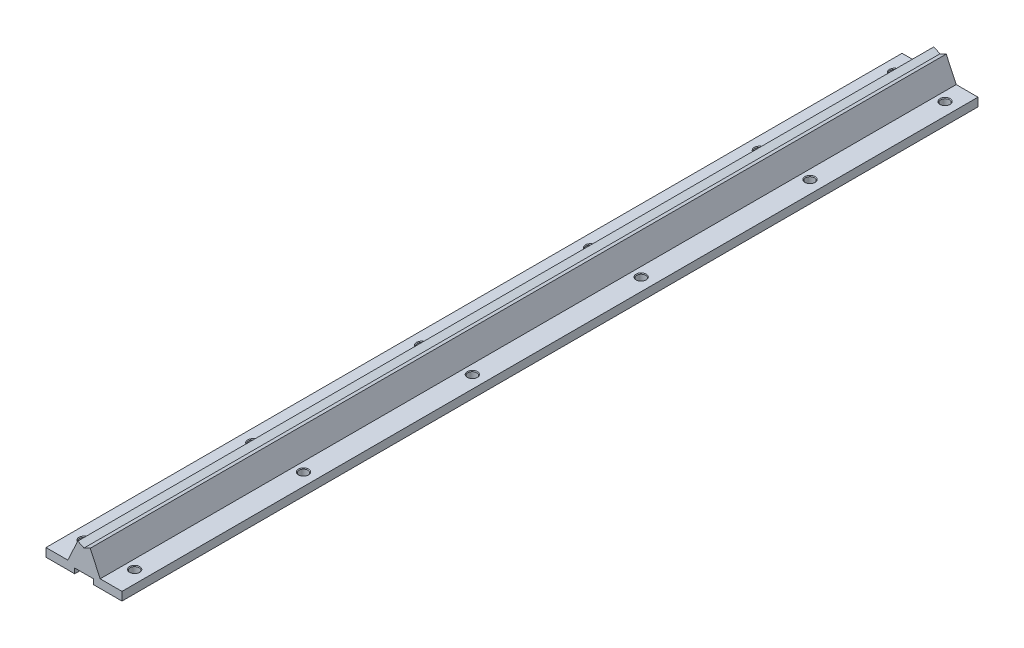
ISO-10303-21;
HEADER;
FILE_DESCRIPTION(('STEP AP214'),'2;1');
FILE_NAME('part.step','',(''),(''),'','','');
FILE_SCHEMA(('AUTOMOTIVE_DESIGN { 1 0 10303 214 1 1 1 1 }'));
ENDSEC;
DATA;
#1=APPLICATION_CONTEXT('core data for automotive mechanical design processes');
#2=APPLICATION_PROTOCOL_DEFINITION('international standard','automotive_design',2000,#1);
#3=PRODUCT_CONTEXT('',#1,'mechanical');
#4=PRODUCT('Part','Part','',(#3));
#5=PRODUCT_RELATED_PRODUCT_CATEGORY('part','',(#4));
#6=PRODUCT_DEFINITION_FORMATION('','',#4);
#7=PRODUCT_DEFINITION_CONTEXT('part definition',#1,'design');
#8=PRODUCT_DEFINITION('design','',#6,#7);
#9=PRODUCT_DEFINITION_SHAPE('','',#8);
#10=(LENGTH_UNIT() NAMED_UNIT(*) SI_UNIT(.MILLI.,.METRE.));
#11=(NAMED_UNIT(*) PLANE_ANGLE_UNIT() SI_UNIT($,.RADIAN.));
#12=(NAMED_UNIT(*) SI_UNIT($,.STERADIAN.) SOLID_ANGLE_UNIT());
#13=UNCERTAINTY_MEASURE_WITH_UNIT(LENGTH_MEASURE(1.E-05),#10,'distance_accuracy_value','');
#14=(GEOMETRIC_REPRESENTATION_CONTEXT(3) GLOBAL_UNCERTAINTY_ASSIGNED_CONTEXT((#13)) GLOBAL_UNIT_ASSIGNED_CONTEXT((#10,
#11,#12)) REPRESENTATION_CONTEXT('',''));
#15=CARTESIAN_POINT('',(0.,0.,0.));
#16=DIRECTION('',(0.,0.,1.));
#17=DIRECTION('',(1.,0.,0.));
#18=AXIS2_PLACEMENT_3D('',#15,#16,#17);
#19=CARTESIAN_POINT('',(9.5977024484662,5.,507.));
#20=DIRECTION('',(0.,-1.,0.));
#21=DIRECTION('',(0.,0.,-1.));
#22=AXIS2_PLACEMENT_3D('',#19,#20,#21);
#23=PLANE('',#22);
#24=CARTESIAN_POINT('',(15.,5.,12.));
#25=DIRECTION('',(0.,1.,0.));
#26=DIRECTION('',(0.,0.,1.));
#27=AXIS2_PLACEMENT_3D('',#24,#25,#26);
#28=CIRCLE('',#27,3.);
#29=CARTESIAN_POINT('',(15.,5.,15.));
#30=VERTEX_POINT('',#29);
#31=EDGE_CURVE('E273',#30,#30,#28,.T.);
#32=ORIENTED_EDGE('',*,*,#31,.F.);
#33=EDGE_LOOP('',(#32));
#34=FACE_BOUND('',#33,.T.);
#35=CARTESIAN_POINT('',(15.,5.,92.));
#36=DIRECTION('',(0.,1.,0.));
#37=DIRECTION('',(0.,0.,1.));
#38=AXIS2_PLACEMENT_3D('',#35,#36,#37);
#39=CIRCLE('',#38,3.);
#40=CARTESIAN_POINT('',(15.,5.,95.));
#41=VERTEX_POINT('',#40);
#42=EDGE_CURVE('E262',#41,#41,#39,.T.);
#43=ORIENTED_EDGE('',*,*,#42,.F.);
#44=EDGE_LOOP('',(#43));
#45=FACE_BOUND('',#44,.T.);
#46=CARTESIAN_POINT('',(15.,5.,192.));
#47=DIRECTION('',(0.,1.,0.));
#48=DIRECTION('',(0.,0.,1.));
#49=AXIS2_PLACEMENT_3D('',#46,#47,#48);
#50=CIRCLE('',#49,3.);
#51=CARTESIAN_POINT('',(15.,5.,195.));
#52=VERTEX_POINT('',#51);
#53=EDGE_CURVE('E253',#52,#52,#50,.T.);
#54=ORIENTED_EDGE('',*,*,#53,.F.);
#55=EDGE_LOOP('',(#54));
#56=FACE_BOUND('',#55,.T.);
#57=CARTESIAN_POINT('',(15.,5.,392.));
#58=DIRECTION('',(0.,1.,0.));
#59=DIRECTION('',(0.,0.,1.));
#60=AXIS2_PLACEMENT_3D('',#57,#58,#59);
#61=CIRCLE('',#60,3.);
#62=CARTESIAN_POINT('',(15.,5.,395.));
#63=VERTEX_POINT('',#62);
#64=EDGE_CURVE('E233',#63,#63,#61,.T.);
#65=ORIENTED_EDGE('',*,*,#64,.F.);
#66=EDGE_LOOP('',(#65));
#67=FACE_BOUND('',#66,.T.);
#68=CARTESIAN_POINT('',(14.9999999999999,5.,492.));
#69=DIRECTION('',(0.,1.,0.));
#70=DIRECTION('',(0.,0.,1.));
#71=AXIS2_PLACEMENT_3D('',#68,#69,#70);
#72=CIRCLE('',#71,3.);
#73=CARTESIAN_POINT('',(14.9999999999999,5.,495.));
#74=VERTEX_POINT('',#73);
#75=EDGE_CURVE('E223',#74,#74,#72,.T.);
#76=ORIENTED_EDGE('',*,*,#75,.F.);
#77=EDGE_LOOP('',(#76));
#78=FACE_BOUND('',#77,.T.);
#79=DIRECTION('',(-1.,0.,0.));
#80=VECTOR('',#79,1.);
#81=CARTESIAN_POINT('',(9.5977024484662,5.,0.));
#82=LINE('',#81,#80);
#83=CARTESIAN_POINT('',(22.5,5.,0.));
#84=VERTEX_POINT('',#83);
#85=CARTESIAN_POINT('',(9.5977024484662,5.,0.));
#86=VERTEX_POINT('',#85);
#87=EDGE_CURVE('E171',#84,#86,#82,.T.);
#88=ORIENTED_EDGE('',*,*,#87,.T.);
#89=DIRECTION('',(0.,0.,-1.));
#90=VECTOR('',#89,1.);
#91=CARTESIAN_POINT('',(9.5977024484662,5.,507.));
#92=LINE('',#91,#90);
#93=CARTESIAN_POINT('',(9.5977024484662,5.,507.));
#94=VERTEX_POINT('',#93);
#95=EDGE_CURVE('E212',#94,#86,#92,.T.);
#96=ORIENTED_EDGE('',*,*,#95,.F.);
#97=DIRECTION('',(-1.,0.,0.));
#98=VECTOR('',#97,1.);
#99=CARTESIAN_POINT('',(9.5977024484662,5.,507.));
#100=LINE('',#99,#98);
#101=CARTESIAN_POINT('',(22.5,5.,507.));
#102=VERTEX_POINT('',#101);
#103=EDGE_CURVE('E321',#102,#94,#100,.T.);
#104=ORIENTED_EDGE('',*,*,#103,.F.);
#105=DIRECTION('',(0.,0.,-1.));
#106=VECTOR('',#105,1.);
#107=CARTESIAN_POINT('',(22.5,5.,507.));
#108=LINE('',#107,#106);
#109=EDGE_CURVE('E46',#102,#84,#108,.T.);
#110=ORIENTED_EDGE('',*,*,#109,.T.);
#111=EDGE_LOOP('',(#88,#96,#104,#110));
#112=FACE_BOUND('',#111,.T.);
#113=CARTESIAN_POINT('',(15.,5.,292.));
#114=DIRECTION('',(0.,1.,0.));
#115=DIRECTION('',(0.,0.,1.));
#116=AXIS2_PLACEMENT_3D('',#113,#114,#115);
#117=CIRCLE('',#116,3.);
#118=CARTESIAN_POINT('',(15.,5.,295.));
#119=VERTEX_POINT('',#118);
#120=EDGE_CURVE('E243',#119,#119,#117,.T.);
#121=ORIENTED_EDGE('',*,*,#120,.F.);
#122=EDGE_LOOP('',(#121));
#123=FACE_BOUND('',#122,.T.);
#124=ADVANCED_FACE('F36',(#34,#45,#56,#67,#78,#112,#123),#23,.F.);
#125=CARTESIAN_POINT('',(5.5,0.,507.));
#126=DIRECTION('',(0.,1.,0.));
#127=DIRECTION('',(-1.,0.,0.));
#128=AXIS2_PLACEMENT_3D('',#125,#126,#127);
#129=PLANE('',#128);
#130=CARTESIAN_POINT('',(15.,0.,12.));
#131=DIRECTION('',(0.,1.,0.));
#132=DIRECTION('',(-1.,0.,0.));
#133=AXIS2_PLACEMENT_3D('',#130,#131,#132);
#134=CIRCLE('',#133,2.59999999999999);
#135=CARTESIAN_POINT('',(12.4,0.,12.));
#136=VERTEX_POINT('',#135);
#137=EDGE_CURVE('E264',#136,#136,#134,.T.);
#138=ORIENTED_EDGE('',*,*,#137,.T.);
#139=EDGE_LOOP('',(#138));
#140=FACE_BOUND('',#139,.T.);
#141=CARTESIAN_POINT('',(15.,0.,92.));
#142=DIRECTION('',(0.,1.,0.));
#143=DIRECTION('',(-1.,0.,0.));
#144=AXIS2_PLACEMENT_3D('',#141,#142,#143);
#145=CIRCLE('',#144,2.59999999999999);
#146=CARTESIAN_POINT('',(12.4,0.,92.));
#147=VERTEX_POINT('',#146);
#148=EDGE_CURVE('E255',#147,#147,#145,.T.);
#149=ORIENTED_EDGE('',*,*,#148,.T.);
#150=EDGE_LOOP('',(#149));
#151=FACE_BOUND('',#150,.T.);
#152=CARTESIAN_POINT('',(15.,0.,192.));
#153=DIRECTION('',(0.,1.,0.));
#154=DIRECTION('',(-1.,0.,0.));
#155=AXIS2_PLACEMENT_3D('',#152,#153,#154);
#156=CIRCLE('',#155,2.59999999999999);
#157=CARTESIAN_POINT('',(12.4,0.,192.));
#158=VERTEX_POINT('',#157);
#159=EDGE_CURVE('E245',#158,#158,#156,.T.);
#160=ORIENTED_EDGE('',*,*,#159,.T.);
#161=EDGE_LOOP('',(#160));
#162=FACE_BOUND('',#161,.T.);
#163=CARTESIAN_POINT('',(15.,0.,292.));
#164=DIRECTION('',(0.,1.,0.));
#165=DIRECTION('',(-1.,0.,0.));
#166=AXIS2_PLACEMENT_3D('',#163,#164,#165);
#167=CIRCLE('',#166,2.59999999999999);
#168=CARTESIAN_POINT('',(12.4,0.,292.));
#169=VERTEX_POINT('',#168);
#170=EDGE_CURVE('E235',#169,#169,#167,.T.);
#171=ORIENTED_EDGE('',*,*,#170,.T.);
#172=EDGE_LOOP('',(#171));
#173=FACE_BOUND('',#172,.T.);
#174=CARTESIAN_POINT('',(15.,0.,392.));
#175=DIRECTION('',(0.,1.,0.));
#176=DIRECTION('',(-1.,0.,0.));
#177=AXIS2_PLACEMENT_3D('',#174,#175,#176);
#178=CIRCLE('',#177,2.59999999999999);
#179=CARTESIAN_POINT('',(12.4,0.,392.));
#180=VERTEX_POINT('',#179);
#181=EDGE_CURVE('E225',#180,#180,#178,.T.);
#182=ORIENTED_EDGE('',*,*,#181,.T.);
#183=EDGE_LOOP('',(#182));
#184=FACE_BOUND('',#183,.T.);
#185=CARTESIAN_POINT('',(14.9999999999999,0.,492.));
#186=DIRECTION('',(0.,1.,0.));
#187=DIRECTION('',(-1.,0.,0.));
#188=AXIS2_PLACEMENT_3D('',#185,#186,#187);
#189=CIRCLE('',#188,2.59999999999999);
#190=CARTESIAN_POINT('',(12.3999999999999,0.,492.));
#191=VERTEX_POINT('',#190);
#192=EDGE_CURVE('E169',#191,#191,#189,.T.);
#193=ORIENTED_EDGE('',*,*,#192,.T.);
#194=EDGE_LOOP('',(#193));
#195=FACE_BOUND('',#194,.T.);
#196=DIRECTION('',(1.,0.,0.));
#197=VECTOR('',#196,1.);
#198=CARTESIAN_POINT('',(5.5,0.,0.));
#199=LINE('',#198,#197);
#200=CARTESIAN_POINT('',(5.5,0.,0.));
#201=VERTEX_POINT('',#200);
#202=CARTESIAN_POINT('',(22.5,0.,0.));
#203=VERTEX_POINT('',#202);
#204=EDGE_CURVE('E165',#201,#203,#199,.T.);
#205=ORIENTED_EDGE('',*,*,#204,.T.);
#206=DIRECTION('',(0.,0.,-1.));
#207=VECTOR('',#206,1.);
#208=CARTESIAN_POINT('',(22.5,0.,507.));
#209=LINE('',#208,#207);
#210=CARTESIAN_POINT('',(22.5,0.,507.));
#211=VERTEX_POINT('',#210);
#212=EDGE_CURVE('E11',#211,#203,#209,.T.);
#213=ORIENTED_EDGE('',*,*,#212,.F.);
#214=DIRECTION('',(1.,0.,0.));
#215=VECTOR('',#214,1.);
#216=CARTESIAN_POINT('',(5.5,0.,507.));
#217=LINE('',#216,#215);
#218=CARTESIAN_POINT('',(5.5,0.,507.));
#219=VERTEX_POINT('',#218);
#220=EDGE_CURVE('E190',#219,#211,#217,.T.);
#221=ORIENTED_EDGE('',*,*,#220,.F.);
#222=DIRECTION('',(0.,0.,-1.));
#223=VECTOR('',#222,1.);
#224=CARTESIAN_POINT('',(5.5,0.,507.));
#225=LINE('',#224,#223);
#226=EDGE_CURVE('E161',#219,#201,#225,.T.);
#227=ORIENTED_EDGE('',*,*,#226,.T.);
#228=EDGE_LOOP('',(#205,#213,#221,#227));
#229=FACE_BOUND('',#228,.T.);
#230=ADVANCED_FACE('F38',(#140,#151,#162,#173,#184,#195,#229),#129,.F.);
#231=CARTESIAN_POINT('',(22.5,0.,507.));
#232=DIRECTION('',(-1.,0.,0.));
#233=DIRECTION('',(0.,0.,1.));
#234=AXIS2_PLACEMENT_3D('',#231,#232,#233);
#235=PLANE('',#234);
#236=DIRECTION('',(0.,1.,0.));
#237=VECTOR('',#236,1.);
#238=CARTESIAN_POINT('',(22.5,0.,0.));
#239=LINE('',#238,#237);
#240=EDGE_CURVE('E168',#203,#84,#239,.T.);
#241=ORIENTED_EDGE('',*,*,#240,.T.);
#242=ORIENTED_EDGE('',*,*,#109,.F.);
#243=DIRECTION('',(0.,1.,0.));
#244=VECTOR('',#243,1.);
#245=CARTESIAN_POINT('',(22.5,0.,507.));
#246=LINE('',#245,#244);
#247=EDGE_CURVE('E113',#211,#102,#246,.T.);
#248=ORIENTED_EDGE('',*,*,#247,.F.);
#249=ORIENTED_EDGE('',*,*,#212,.T.);
#250=EDGE_LOOP('',(#241,#242,#248,#249));
#251=FACE_BOUND('',#250,.T.);
#252=ADVANCED_FACE('F367',(#251),#235,.F.);
#253=CARTESIAN_POINT('',(3.67559518989782,17.7,507.));
#254=DIRECTION('',(-0.906307787036653,-0.422618261740694,0.));
#255=DIRECTION('',(0.422618261740694,-0.906307787036653,0.));
#256=AXIS2_PLACEMENT_3D('',#253,#254,#255);
#257=PLANE('',#256);
#258=DIRECTION('',(-0.422618261740694,0.906307787036653,0.));
#259=VECTOR('',#258,1.);
#260=CARTESIAN_POINT('',(3.67559518989782,17.7,0.));
#261=LINE('',#260,#259);
#262=CARTESIAN_POINT('',(3.67559518989782,17.7,0.));
#263=VERTEX_POINT('',#262);
#264=EDGE_CURVE('E173',#86,#263,#261,.T.);
#265=ORIENTED_EDGE('',*,*,#264,.T.);
#266=DIRECTION('',(0.,0.,-1.));
#267=VECTOR('',#266,1.);
#268=CARTESIAN_POINT('',(3.67559518989782,17.7,507.));
#269=LINE('',#268,#267);
#270=CARTESIAN_POINT('',(3.67559518989782,17.7,507.));
#271=VERTEX_POINT('',#270);
#272=EDGE_CURVE('E209',#271,#263,#269,.T.);
#273=ORIENTED_EDGE('',*,*,#272,.F.);
#274=DIRECTION('',(-0.422618261740694,0.906307787036653,0.));
#275=VECTOR('',#274,1.);
#276=CARTESIAN_POINT('',(3.67559518989782,17.7,507.));
#277=LINE('',#276,#275);
#278=EDGE_CURVE('E323',#94,#271,#277,.T.);
#279=ORIENTED_EDGE('',*,*,#278,.F.);
#280=ORIENTED_EDGE('',*,*,#95,.T.);
#281=EDGE_LOOP('',(#265,#273,#279,#280));
#282=FACE_BOUND('',#281,.T.);
#283=ADVANCED_FACE('F371',(#282),#257,.F.);
#284=CARTESIAN_POINT('',(3.67559518989782,17.7,507.));
#285=DIRECTION('',(0.422618261740697,-0.906307787036651,0.));
#286=DIRECTION('',(0.906307787036651,0.422618261740697,0.));
#287=AXIS2_PLACEMENT_3D('',#284,#285,#286);
#288=PLANE('',#287);
#289=DIRECTION('',(-0.906307787036651,-0.422618261740697,0.));
#290=VECTOR('',#289,1.);
#291=CARTESIAN_POINT('',(3.67559518989782,17.7,0.));
#292=LINE('',#291,#290);
#293=CARTESIAN_POINT('',(0.,15.986041814673,0.));
#294=VERTEX_POINT('',#293);
#295=EDGE_CURVE('E175',#263,#294,#292,.T.);
#296=ORIENTED_EDGE('',*,*,#295,.T.);
#297=DIRECTION('',(0.,0.,-1.));
#298=VECTOR('',#297,1.);
#299=CARTESIAN_POINT('',(0.,15.986041814673,507.));
#300=LINE('',#299,#298);
#301=CARTESIAN_POINT('',(0.,15.986041814673,507.));
#302=VERTEX_POINT('',#301);
#303=EDGE_CURVE('E206',#302,#294,#300,.T.);
#304=ORIENTED_EDGE('',*,*,#303,.F.);
#305=DIRECTION('',(-0.906307787036651,-0.422618261740697,0.));
#306=VECTOR('',#305,1.);
#307=CARTESIAN_POINT('',(3.67559518989782,17.7,507.));
#308=LINE('',#307,#306);
#309=EDGE_CURVE('E325',#271,#302,#308,.T.);
#310=ORIENTED_EDGE('',*,*,#309,.F.);
#311=ORIENTED_EDGE('',*,*,#272,.T.);
#312=EDGE_LOOP('',(#296,#304,#310,#311));
#313=FACE_BOUND('',#312,.T.);
#314=ADVANCED_FACE('F377',(#313),#288,.F.);
#315=CARTESIAN_POINT('',(-3.67559518989782,17.7,507.));
#316=DIRECTION('',(-0.422618261740697,-0.906307787036651,0.));
#317=DIRECTION('',(0.906307787036651,-0.422618261740697,0.));
#318=AXIS2_PLACEMENT_3D('',#315,#316,#317);
#319=PLANE('',#318);
#320=DIRECTION('',(-0.906307787036651,0.422618261740697,0.));
#321=VECTOR('',#320,1.);
#322=CARTESIAN_POINT('',(-3.67559518989782,17.7,0.));
#323=LINE('',#322,#321);
#324=CARTESIAN_POINT('',(-3.67559518989782,17.7,0.));
#325=VERTEX_POINT('',#324);
#326=EDGE_CURVE('E177',#294,#325,#323,.T.);
#327=ORIENTED_EDGE('',*,*,#326,.T.);
#328=DIRECTION('',(0.,0.,-1.));
#329=VECTOR('',#328,1.);
#330=CARTESIAN_POINT('',(-3.67559518989782,17.7,507.));
#331=LINE('',#330,#329);
#332=CARTESIAN_POINT('',(-3.67559518989782,17.7,507.));
#333=VERTEX_POINT('',#332);
#334=EDGE_CURVE('E203',#333,#325,#331,.T.);
#335=ORIENTED_EDGE('',*,*,#334,.F.);
#336=DIRECTION('',(-0.906307787036651,0.422618261740697,0.));
#337=VECTOR('',#336,1.);
#338=CARTESIAN_POINT('',(-3.67559518989782,17.7,507.));
#339=LINE('',#338,#337);
#340=EDGE_CURVE('E327',#302,#333,#339,.T.);
#341=ORIENTED_EDGE('',*,*,#340,.F.);
#342=ORIENTED_EDGE('',*,*,#303,.T.);
#343=EDGE_LOOP('',(#327,#335,#341,#342));
#344=FACE_BOUND('',#343,.T.);
#345=ADVANCED_FACE('F396',(#344),#319,.F.);
#346=CARTESIAN_POINT('',(-3.67559518989782,17.7,507.));
#347=DIRECTION('',(0.906307787036653,-0.422618261740694,0.));
#348=DIRECTION('',(0.422618261740694,0.906307787036653,0.));
#349=AXIS2_PLACEMENT_3D('',#346,#347,#348);
#350=PLANE('',#349);
#351=DIRECTION('',(-0.422618261740694,-0.906307787036653,0.));
#352=VECTOR('',#351,1.);
#353=CARTESIAN_POINT('',(-3.67559518989782,17.7,0.));
#354=LINE('',#353,#352);
#355=CARTESIAN_POINT('',(-9.5977024484662,5.,0.));
#356=VERTEX_POINT('',#355);
#357=EDGE_CURVE('E179',#325,#356,#354,.T.);
#358=ORIENTED_EDGE('',*,*,#357,.T.);
#359=DIRECTION('',(0.,0.,-1.));
#360=VECTOR('',#359,1.);
#361=CARTESIAN_POINT('',(-9.5977024484662,5.,507.));
#362=LINE('',#361,#360);
#363=CARTESIAN_POINT('',(-9.5977024484662,5.,507.));
#364=VERTEX_POINT('',#363);
#365=EDGE_CURVE('E200',#364,#356,#362,.T.);
#366=ORIENTED_EDGE('',*,*,#365,.F.);
#367=DIRECTION('',(-0.422618261740694,-0.906307787036653,0.));
#368=VECTOR('',#367,1.);
#369=CARTESIAN_POINT('',(-3.67559518989782,17.7,507.));
#370=LINE('',#369,#368);
#371=EDGE_CURVE('E329',#333,#364,#370,.T.);
#372=ORIENTED_EDGE('',*,*,#371,.F.);
#373=ORIENTED_EDGE('',*,*,#334,.T.);
#374=EDGE_LOOP('',(#358,#366,#372,#373));
#375=FACE_BOUND('',#374,.T.);
#376=ADVANCED_FACE('F399',(#375),#350,.F.);
#377=CARTESIAN_POINT('',(-22.5,5.,507.));
#378=DIRECTION('',(0.,-1.,0.));
#379=DIRECTION('',(0.,0.,-1.));
#380=AXIS2_PLACEMENT_3D('',#377,#378,#379);
#381=PLANE('',#380);
#382=CARTESIAN_POINT('',(-15.,5.,12.));
#383=DIRECTION('',(0.,1.,0.));
#384=DIRECTION('',(0.,0.,1.));
#385=AXIS2_PLACEMENT_3D('',#382,#383,#384);
#386=CIRCLE('',#385,3.);
#387=CARTESIAN_POINT('',(-15.,5.,15.));
#388=VERTEX_POINT('',#387);
#389=EDGE_CURVE('E738',#388,#388,#386,.T.);
#390=ORIENTED_EDGE('',*,*,#389,.F.);
#391=EDGE_LOOP('',(#390));
#392=FACE_BOUND('',#391,.T.);
#393=CARTESIAN_POINT('',(-15.,5.,92.));
#394=DIRECTION('',(0.,1.,0.));
#395=DIRECTION('',(0.,0.,1.));
#396=AXIS2_PLACEMENT_3D('',#393,#394,#395);
#397=CIRCLE('',#396,3.);
#398=CARTESIAN_POINT('',(-15.,5.,95.));
#399=VERTEX_POINT('',#398);
#400=EDGE_CURVE('E266',#399,#399,#397,.T.);
#401=ORIENTED_EDGE('',*,*,#400,.F.);
#402=EDGE_LOOP('',(#401));
#403=FACE_BOUND('',#402,.T.);
#404=CARTESIAN_POINT('',(-15.,5.,192.));
#405=DIRECTION('',(0.,1.,0.));
#406=DIRECTION('',(0.,0.,1.));
#407=AXIS2_PLACEMENT_3D('',#404,#405,#406);
#408=CIRCLE('',#407,3.);
#409=CARTESIAN_POINT('',(-15.,5.,195.));
#410=VERTEX_POINT('',#409);
#411=EDGE_CURVE('E258',#410,#410,#408,.T.);
#412=ORIENTED_EDGE('',*,*,#411,.F.);
#413=EDGE_LOOP('',(#412));
#414=FACE_BOUND('',#413,.T.);
#415=CARTESIAN_POINT('',(-15.,5.,292.));
#416=DIRECTION('',(0.,1.,0.));
#417=DIRECTION('',(0.,0.,1.));
#418=AXIS2_PLACEMENT_3D('',#415,#416,#417);
#419=CIRCLE('',#418,3.);
#420=CARTESIAN_POINT('',(-15.,5.,295.));
#421=VERTEX_POINT('',#420);
#422=EDGE_CURVE('E248',#421,#421,#419,.T.);
#423=ORIENTED_EDGE('',*,*,#422,.F.);
#424=EDGE_LOOP('',(#423));
#425=FACE_BOUND('',#424,.T.);
#426=CARTESIAN_POINT('',(-15.,5.,392.));
#427=DIRECTION('',(0.,1.,0.));
#428=DIRECTION('',(0.,0.,1.));
#429=AXIS2_PLACEMENT_3D('',#426,#427,#428);
#430=CIRCLE('',#429,3.);
#431=CARTESIAN_POINT('',(-15.,5.,395.));
#432=VERTEX_POINT('',#431);
#433=EDGE_CURVE('E238',#432,#432,#430,.T.);
#434=ORIENTED_EDGE('',*,*,#433,.F.);
#435=EDGE_LOOP('',(#434));
#436=FACE_BOUND('',#435,.T.);
#437=CARTESIAN_POINT('',(-14.9999999999999,5.,492.));
#438=DIRECTION('',(0.,1.,0.));
#439=DIRECTION('',(0.,0.,1.));
#440=AXIS2_PLACEMENT_3D('',#437,#438,#439);
#441=CIRCLE('',#440,3.);
#442=CARTESIAN_POINT('',(-14.9999999999999,5.,495.));
#443=VERTEX_POINT('',#442);
#444=EDGE_CURVE('E228',#443,#443,#441,.T.);
#445=ORIENTED_EDGE('',*,*,#444,.F.);
#446=EDGE_LOOP('',(#445));
#447=FACE_BOUND('',#446,.T.);
#448=DIRECTION('',(-1.,0.,0.));
#449=VECTOR('',#448,1.);
#450=CARTESIAN_POINT('',(-22.5,5.,0.));
#451=LINE('',#450,#449);
#452=CARTESIAN_POINT('',(-22.5,5.,0.));
#453=VERTEX_POINT('',#452);
#454=EDGE_CURVE('E181',#356,#453,#451,.T.);
#455=ORIENTED_EDGE('',*,*,#454,.T.);
#456=DIRECTION('',(0.,0.,-1.));
#457=VECTOR('',#456,1.);
#458=CARTESIAN_POINT('',(-22.5,5.,507.));
#459=LINE('',#458,#457);
#460=CARTESIAN_POINT('',(-22.5,5.,507.));
#461=VERTEX_POINT('',#460);
#462=EDGE_CURVE('E197',#461,#453,#459,.T.);
#463=ORIENTED_EDGE('',*,*,#462,.F.);
#464=DIRECTION('',(-1.,0.,0.));
#465=VECTOR('',#464,1.);
#466=CARTESIAN_POINT('',(-22.5,5.,507.));
#467=LINE('',#466,#465);
#468=EDGE_CURVE('E331',#364,#461,#467,.T.);
#469=ORIENTED_EDGE('',*,*,#468,.F.);
#470=ORIENTED_EDGE('',*,*,#365,.T.);
#471=EDGE_LOOP('',(#455,#463,#469,#470));
#472=FACE_BOUND('',#471,.T.);
#473=ADVANCED_FACE('F402',(#392,#403,#414,#425,#436,#447,#472),#381,.F.);
#474=CARTESIAN_POINT('',(-22.5,0.,507.));
#475=DIRECTION('',(1.,0.,0.));
#476=DIRECTION('',(0.,0.,-1.));
#477=AXIS2_PLACEMENT_3D('',#474,#475,#476);
#478=PLANE('',#477);
#479=DIRECTION('',(0.,-1.,0.));
#480=VECTOR('',#479,1.);
#481=CARTESIAN_POINT('',(-22.5,0.,0.));
#482=LINE('',#481,#480);
#483=CARTESIAN_POINT('',(-22.5,0.,0.));
#484=VERTEX_POINT('',#483);
#485=EDGE_CURVE('E183',#453,#484,#482,.T.);
#486=ORIENTED_EDGE('',*,*,#485,.T.);
#487=DIRECTION('',(0.,0.,-1.));
#488=VECTOR('',#487,1.);
#489=CARTESIAN_POINT('',(-22.5,0.,507.));
#490=LINE('',#489,#488);
#491=CARTESIAN_POINT('',(-22.5,0.,507.));
#492=VERTEX_POINT('',#491);
#493=EDGE_CURVE('E194',#492,#484,#490,.T.);
#494=ORIENTED_EDGE('',*,*,#493,.F.);
#495=DIRECTION('',(0.,-1.,0.));
#496=VECTOR('',#495,1.);
#497=CARTESIAN_POINT('',(-22.5,0.,507.));
#498=LINE('',#497,#496);
#499=EDGE_CURVE('E333',#461,#492,#498,.T.);
#500=ORIENTED_EDGE('',*,*,#499,.F.);
#501=ORIENTED_EDGE('',*,*,#462,.T.);
#502=EDGE_LOOP('',(#486,#494,#500,#501));
#503=FACE_BOUND('',#502,.T.);
#504=ADVANCED_FACE('F339',(#503),#478,.F.);
#505=CARTESIAN_POINT('',(-5.5,0.,507.));
#506=DIRECTION('',(0.,1.,0.));
#507=DIRECTION('',(-1.,0.,0.));
#508=AXIS2_PLACEMENT_3D('',#505,#506,#507);
#509=PLANE('',#508);
#510=CARTESIAN_POINT('',(-15.,0.,12.));
#511=DIRECTION('',(0.,1.,0.));
#512=DIRECTION('',(-1.,0.,0.));
#513=AXIS2_PLACEMENT_3D('',#510,#511,#512);
#514=CIRCLE('',#513,2.59999999999999);
#515=CARTESIAN_POINT('',(-17.6,0.,12.));
#516=VERTEX_POINT('',#515);
#517=EDGE_CURVE('E40',#516,#516,#514,.T.);
#518=ORIENTED_EDGE('',*,*,#517,.T.);
#519=EDGE_LOOP('',(#518));
#520=FACE_BOUND('',#519,.T.);
#521=CARTESIAN_POINT('',(-15.,0.,92.));
#522=DIRECTION('',(0.,1.,0.));
#523=DIRECTION('',(-1.,0.,0.));
#524=AXIS2_PLACEMENT_3D('',#521,#522,#523);
#525=CIRCLE('',#524,2.59999999999999);
#526=CARTESIAN_POINT('',(-17.6,0.,92.));
#527=VERTEX_POINT('',#526);
#528=EDGE_CURVE('E260',#527,#527,#525,.T.);
#529=ORIENTED_EDGE('',*,*,#528,.T.);
#530=EDGE_LOOP('',(#529));
#531=FACE_BOUND('',#530,.T.);
#532=CARTESIAN_POINT('',(-15.,0.,192.));
#533=DIRECTION('',(0.,1.,0.));
#534=DIRECTION('',(-1.,0.,0.));
#535=AXIS2_PLACEMENT_3D('',#532,#533,#534);
#536=CIRCLE('',#535,2.59999999999999);
#537=CARTESIAN_POINT('',(-17.6,0.,192.));
#538=VERTEX_POINT('',#537);
#539=EDGE_CURVE('E250',#538,#538,#536,.T.);
#540=ORIENTED_EDGE('',*,*,#539,.T.);
#541=EDGE_LOOP('',(#540));
#542=FACE_BOUND('',#541,.T.);
#543=CARTESIAN_POINT('',(-15.,0.,292.));
#544=DIRECTION('',(0.,1.,0.));
#545=DIRECTION('',(-1.,0.,0.));
#546=AXIS2_PLACEMENT_3D('',#543,#544,#545);
#547=CIRCLE('',#546,2.59999999999999);
#548=CARTESIAN_POINT('',(-17.6,0.,292.));
#549=VERTEX_POINT('',#548);
#550=EDGE_CURVE('E240',#549,#549,#547,.T.);
#551=ORIENTED_EDGE('',*,*,#550,.T.);
#552=EDGE_LOOP('',(#551));
#553=FACE_BOUND('',#552,.T.);
#554=CARTESIAN_POINT('',(-15.,0.,392.));
#555=DIRECTION('',(0.,1.,0.));
#556=DIRECTION('',(-1.,0.,0.));
#557=AXIS2_PLACEMENT_3D('',#554,#555,#556);
#558=CIRCLE('',#557,2.59999999999999);
#559=CARTESIAN_POINT('',(-17.5999999999999,0.,392.));
#560=VERTEX_POINT('',#559);
#561=EDGE_CURVE('E230',#560,#560,#558,.T.);
#562=ORIENTED_EDGE('',*,*,#561,.T.);
#563=EDGE_LOOP('',(#562));
#564=FACE_BOUND('',#563,.T.);
#565=CARTESIAN_POINT('',(-14.9999999999999,0.,492.));
#566=DIRECTION('',(0.,1.,0.));
#567=DIRECTION('',(-1.,0.,0.));
#568=AXIS2_PLACEMENT_3D('',#565,#566,#567);
#569=CIRCLE('',#568,2.59999999999999);
#570=CARTESIAN_POINT('',(-17.5999999999999,0.,492.));
#571=VERTEX_POINT('',#570);
#572=EDGE_CURVE('E220',#571,#571,#569,.T.);
#573=ORIENTED_EDGE('',*,*,#572,.T.);
#574=EDGE_LOOP('',(#573));
#575=FACE_BOUND('',#574,.T.);
#576=DIRECTION('',(1.,0.,0.));
#577=VECTOR('',#576,1.);
#578=CARTESIAN_POINT('',(-5.5,0.,0.));
#579=LINE('',#578,#577);
#580=CARTESIAN_POINT('',(-5.5,0.,0.));
#581=VERTEX_POINT('',#580);
#582=EDGE_CURVE('E185',#484,#581,#579,.T.);
#583=ORIENTED_EDGE('',*,*,#582,.T.);
#584=DIRECTION('',(0.,0.,-1.));
#585=VECTOR('',#584,1.);
#586=CARTESIAN_POINT('',(-5.5,0.,507.));
#587=LINE('',#586,#585);
#588=CARTESIAN_POINT('',(-5.5,0.,507.));
#589=VERTEX_POINT('',#588);
#590=EDGE_CURVE('E156',#589,#581,#587,.T.);
#591=ORIENTED_EDGE('',*,*,#590,.F.);
#592=DIRECTION('',(1.,0.,0.));
#593=VECTOR('',#592,1.);
#594=CARTESIAN_POINT('',(-5.5,0.,507.));
#595=LINE('',#594,#593);
#596=EDGE_CURVE('E147',#492,#589,#595,.T.);
#597=ORIENTED_EDGE('',*,*,#596,.F.);
#598=ORIENTED_EDGE('',*,*,#493,.T.);
#599=EDGE_LOOP('',(#583,#591,#597,#598));
#600=FACE_BOUND('',#599,.T.);
#601=ADVANCED_FACE('F343',(#520,#531,#542,#553,#564,#575,#600),#509,.F.);
#602=CARTESIAN_POINT('',(-5.5,3.,507.));
#603=DIRECTION('',(-1.,0.,0.));
#604=DIRECTION('',(0.,0.,1.));
#605=AXIS2_PLACEMENT_3D('',#602,#603,#604);
#606=PLANE('',#605);
#607=DIRECTION('',(0.,1.,0.));
#608=VECTOR('',#607,1.);
#609=CARTESIAN_POINT('',(-5.5,3.,0.));
#610=LINE('',#609,#608);
#611=CARTESIAN_POINT('',(-5.5,3.,0.));
#612=VERTEX_POINT('',#611);
#613=EDGE_CURVE('E155',#581,#612,#610,.T.);
#614=ORIENTED_EDGE('',*,*,#613,.T.);
#615=DIRECTION('',(0.,0.,-1.));
#616=VECTOR('',#615,1.);
#617=CARTESIAN_POINT('',(-5.5,3.,507.));
#618=LINE('',#617,#616);
#619=CARTESIAN_POINT('',(-5.5,3.,507.));
#620=VERTEX_POINT('',#619);
#621=EDGE_CURVE('E152',#620,#612,#618,.T.);
#622=ORIENTED_EDGE('',*,*,#621,.F.);
#623=DIRECTION('',(0.,1.,0.));
#624=VECTOR('',#623,1.);
#625=CARTESIAN_POINT('',(-5.5,3.,507.));
#626=LINE('',#625,#624);
#627=EDGE_CURVE('E141',#589,#620,#626,.T.);
#628=ORIENTED_EDGE('',*,*,#627,.F.);
#629=ORIENTED_EDGE('',*,*,#590,.T.);
#630=EDGE_LOOP('',(#614,#622,#628,#629));
#631=FACE_BOUND('',#630,.T.);
#632=ADVANCED_FACE('F153',(#631),#606,.F.);
#633=CARTESIAN_POINT('',(5.5,3.,507.));
#634=DIRECTION('',(0.,1.,0.));
#635=DIRECTION('',(0.,0.,1.));
#636=AXIS2_PLACEMENT_3D('',#633,#634,#635);
#637=PLANE('',#636);
#638=DIRECTION('',(1.,0.,0.));
#639=VECTOR('',#638,1.);
#640=CARTESIAN_POINT('',(5.5,3.,0.));
#641=LINE('',#640,#639);
#642=CARTESIAN_POINT('',(5.5,3.,0.));
#643=VERTEX_POINT('',#642);
#644=EDGE_CURVE('E99',#612,#643,#641,.T.);
#645=ORIENTED_EDGE('',*,*,#644,.T.);
#646=DIRECTION('',(0.,0.,-1.));
#647=VECTOR('',#646,1.);
#648=CARTESIAN_POINT('',(5.5,3.,507.));
#649=LINE('',#648,#647);
#650=CARTESIAN_POINT('',(5.5,3.,507.));
#651=VERTEX_POINT('',#650);
#652=EDGE_CURVE('E157',#651,#643,#649,.T.);
#653=ORIENTED_EDGE('',*,*,#652,.F.);
#654=DIRECTION('',(1.,0.,0.));
#655=VECTOR('',#654,1.);
#656=CARTESIAN_POINT('',(5.5,3.,507.));
#657=LINE('',#656,#655);
#658=EDGE_CURVE('E145',#620,#651,#657,.T.);
#659=ORIENTED_EDGE('',*,*,#658,.F.);
#660=ORIENTED_EDGE('',*,*,#621,.T.);
#661=EDGE_LOOP('',(#645,#653,#659,#660));
#662=FACE_BOUND('',#661,.T.);
#663=ADVANCED_FACE('F159',(#662),#637,.F.);
#664=CARTESIAN_POINT('',(5.5,3.,507.));
#665=DIRECTION('',(1.,0.,0.));
#666=DIRECTION('',(0.,0.,-1.));
#667=AXIS2_PLACEMENT_3D('',#664,#665,#666);
#668=PLANE('',#667);
#669=DIRECTION('',(0.,-1.,0.));
#670=VECTOR('',#669,1.);
#671=CARTESIAN_POINT('',(5.5,3.,0.));
#672=LINE('',#671,#670);
#673=EDGE_CURVE('E105',#643,#201,#672,.T.);
#674=ORIENTED_EDGE('',*,*,#673,.T.);
#675=ORIENTED_EDGE('',*,*,#226,.F.);
#676=DIRECTION('',(0.,-1.,0.));
#677=VECTOR('',#676,1.);
#678=CARTESIAN_POINT('',(5.5,3.,507.));
#679=LINE('',#678,#677);
#680=EDGE_CURVE('E55',#651,#219,#679,.T.);
#681=ORIENTED_EDGE('',*,*,#680,.F.);
#682=ORIENTED_EDGE('',*,*,#652,.T.);
#683=EDGE_LOOP('',(#674,#675,#681,#682));
#684=FACE_BOUND('',#683,.T.);
#685=ADVANCED_FACE('F351',(#684),#668,.F.);
#686=CARTESIAN_POINT('',(0.,0.,507.));
#687=DIRECTION('',(0.,0.,1.));
#688=DIRECTION('',(1.,0.,0.));
#689=AXIS2_PLACEMENT_3D('',#686,#687,#688);
#690=PLANE('',#689);
#691=ORIENTED_EDGE('',*,*,#220,.T.);
#692=ORIENTED_EDGE('',*,*,#247,.T.);
#693=ORIENTED_EDGE('',*,*,#103,.T.);
#694=ORIENTED_EDGE('',*,*,#278,.T.);
#695=ORIENTED_EDGE('',*,*,#309,.T.);
#696=ORIENTED_EDGE('',*,*,#340,.T.);
#697=ORIENTED_EDGE('',*,*,#371,.T.);
#698=ORIENTED_EDGE('',*,*,#468,.T.);
#699=ORIENTED_EDGE('',*,*,#499,.T.);
#700=ORIENTED_EDGE('',*,*,#596,.T.);
#701=ORIENTED_EDGE('',*,*,#627,.T.);
#702=ORIENTED_EDGE('',*,*,#658,.T.);
#703=ORIENTED_EDGE('',*,*,#680,.T.);
#704=EDGE_LOOP('',(#691,#692,#693,#694,#695,#696,#697,#698,#699,#700,#701,#702,#703));
#705=FACE_BOUND('',#704,.T.);
#706=ADVANCED_FACE('F143',(#705),#690,.T.);
#707=CARTESIAN_POINT('',(0.,0.,0.));
#708=DIRECTION('',(0.,0.,1.));
#709=DIRECTION('',(1.,0.,0.));
#710=AXIS2_PLACEMENT_3D('',#707,#708,#709);
#711=PLANE('',#710);
#712=ORIENTED_EDGE('',*,*,#204,.F.);
#713=ORIENTED_EDGE('',*,*,#673,.F.);
#714=ORIENTED_EDGE('',*,*,#644,.F.);
#715=ORIENTED_EDGE('',*,*,#613,.F.);
#716=ORIENTED_EDGE('',*,*,#582,.F.);
#717=ORIENTED_EDGE('',*,*,#485,.F.);
#718=ORIENTED_EDGE('',*,*,#454,.F.);
#719=ORIENTED_EDGE('',*,*,#357,.F.);
#720=ORIENTED_EDGE('',*,*,#326,.F.);
#721=ORIENTED_EDGE('',*,*,#295,.F.);
#722=ORIENTED_EDGE('',*,*,#264,.F.);
#723=ORIENTED_EDGE('',*,*,#87,.F.);
#724=ORIENTED_EDGE('',*,*,#240,.F.);
#725=EDGE_LOOP('',(#712,#713,#714,#715,#716,#717,#718,#719,#720,#721,#722,#723,#724));
#726=FACE_BOUND('',#725,.T.);
#727=ADVANCED_FACE('F346',(#726),#711,.F.);
#728=CARTESIAN_POINT('',(14.9999999999999,5.,492.));
#729=DIRECTION('',(0.,1.,0.));
#730=DIRECTION('',(0.,0.,1.));
#731=AXIS2_PLACEMENT_3D('',#728,#729,#730);
#732=CYLINDRICAL_SURFACE('',#731,2.59999999999999);
#733=CARTESIAN_POINT('',(14.9999999999999,4.59999999999999,492.));
#734=DIRECTION('',(0.,1.,0.));
#735=DIRECTION('',(0.,0.,1.));
#736=AXIS2_PLACEMENT_3D('',#733,#734,#735);
#737=CIRCLE('',#736,2.6);
#738=CARTESIAN_POINT('',(14.9999999999999,4.59999999999999,494.6));
#739=VERTEX_POINT('',#738);
#740=EDGE_CURVE('E219',#739,#739,#737,.T.);
#741=ORIENTED_EDGE('',*,*,#740,.T.);
#742=EDGE_LOOP('',(#741));
#743=FACE_BOUND('',#742,.T.);
#744=ORIENTED_EDGE('',*,*,#192,.F.);
#745=EDGE_LOOP('',(#744));
#746=FACE_BOUND('',#745,.T.);
#747=ADVANCED_FACE('F471',(#743,#746),#732,.F.);
#748=CARTESIAN_POINT('',(14.9999999999999,5.,492.));
#749=DIRECTION('',(0.,1.,0.));
#750=DIRECTION('',(0.,0.,1.));
#751=AXIS2_PLACEMENT_3D('',#748,#749,#750);
#752=CONICAL_SURFACE('',#751,3.,0.785398163397446);
#753=ORIENTED_EDGE('',*,*,#740,.F.);
#754=EDGE_LOOP('',(#753));
#755=FACE_BOUND('',#754,.T.);
#756=ORIENTED_EDGE('',*,*,#75,.T.);
#757=EDGE_LOOP('',(#756));
#758=FACE_BOUND('',#757,.T.);
#759=ADVANCED_FACE('F500',(#755,#758),#752,.F.);
#760=CARTESIAN_POINT('',(-14.9999999999999,5.,492.));
#761=DIRECTION('',(0.,1.,0.));
#762=DIRECTION('',(0.,0.,1.));
#763=AXIS2_PLACEMENT_3D('',#760,#761,#762);
#764=CYLINDRICAL_SURFACE('',#763,2.59999999999999);
#765=CARTESIAN_POINT('',(-14.9999999999999,4.59999999999999,492.));
#766=DIRECTION('',(0.,1.,0.));
#767=DIRECTION('',(0.,0.,1.));
#768=AXIS2_PLACEMENT_3D('',#765,#766,#767);
#769=CIRCLE('',#768,2.59999999999999);
#770=CARTESIAN_POINT('',(-14.9999999999999,4.59999999999999,494.6));
#771=VERTEX_POINT('',#770);
#772=EDGE_CURVE('E224',#771,#771,#769,.T.);
#773=ORIENTED_EDGE('',*,*,#772,.T.);
#774=EDGE_LOOP('',(#773));
#775=FACE_BOUND('',#774,.T.);
#776=ORIENTED_EDGE('',*,*,#572,.F.);
#777=EDGE_LOOP('',(#776));
#778=FACE_BOUND('',#777,.T.);
#779=ADVANCED_FACE('F510',(#775,#778),#764,.F.);
#780=CARTESIAN_POINT('',(-14.9999999999999,5.,492.));
#781=DIRECTION('',(0.,1.,0.));
#782=DIRECTION('',(0.,0.,1.));
#783=AXIS2_PLACEMENT_3D('',#780,#781,#782);
#784=CONICAL_SURFACE('',#783,3.,0.785398163397446);
#785=ORIENTED_EDGE('',*,*,#772,.F.);
#786=EDGE_LOOP('',(#785));
#787=FACE_BOUND('',#786,.T.);
#788=ORIENTED_EDGE('',*,*,#444,.T.);
#789=EDGE_LOOP('',(#788));
#790=FACE_BOUND('',#789,.T.);
#791=ADVANCED_FACE('F520',(#787,#790),#784,.F.);
#792=CARTESIAN_POINT('',(15.,5.,392.));
#793=DIRECTION('',(0.,1.,0.));
#794=DIRECTION('',(0.,0.,1.));
#795=AXIS2_PLACEMENT_3D('',#792,#793,#794);
#796=CYLINDRICAL_SURFACE('',#795,2.59999999999999);
#797=CARTESIAN_POINT('',(15.,4.59999999999999,392.));
#798=DIRECTION('',(0.,1.,0.));
#799=DIRECTION('',(0.,0.,1.));
#800=AXIS2_PLACEMENT_3D('',#797,#798,#799);
#801=CIRCLE('',#800,2.59999999999999);
#802=CARTESIAN_POINT('',(15.,4.59999999999999,394.6));
#803=VERTEX_POINT('',#802);
#804=EDGE_CURVE('E229',#803,#803,#801,.T.);
#805=ORIENTED_EDGE('',*,*,#804,.T.);
#806=EDGE_LOOP('',(#805));
#807=FACE_BOUND('',#806,.T.);
#808=ORIENTED_EDGE('',*,*,#181,.F.);
#809=EDGE_LOOP('',(#808));
#810=FACE_BOUND('',#809,.T.);
#811=ADVANCED_FACE('F530',(#807,#810),#796,.F.);
#812=CARTESIAN_POINT('',(15.,5.,392.));
#813=DIRECTION('',(0.,1.,0.));
#814=DIRECTION('',(0.,0.,1.));
#815=AXIS2_PLACEMENT_3D('',#812,#813,#814);
#816=CONICAL_SURFACE('',#815,3.,0.785398163397446);
#817=ORIENTED_EDGE('',*,*,#804,.F.);
#818=EDGE_LOOP('',(#817));
#819=FACE_BOUND('',#818,.T.);
#820=ORIENTED_EDGE('',*,*,#64,.T.);
#821=EDGE_LOOP('',(#820));
#822=FACE_BOUND('',#821,.T.);
#823=ADVANCED_FACE('F540',(#819,#822),#816,.F.);
#824=CARTESIAN_POINT('',(-15.,5.,392.));
#825=DIRECTION('',(0.,1.,0.));
#826=DIRECTION('',(0.,0.,1.));
#827=AXIS2_PLACEMENT_3D('',#824,#825,#826);
#828=CYLINDRICAL_SURFACE('',#827,2.59999999999999);
#829=CARTESIAN_POINT('',(-15.,4.59999999999999,392.));
#830=DIRECTION('',(0.,1.,0.));
#831=DIRECTION('',(0.,0.,1.));
#832=AXIS2_PLACEMENT_3D('',#829,#830,#831);
#833=CIRCLE('',#832,2.59999999999999);
#834=CARTESIAN_POINT('',(-15.,4.59999999999999,394.6));
#835=VERTEX_POINT('',#834);
#836=EDGE_CURVE('E234',#835,#835,#833,.T.);
#837=ORIENTED_EDGE('',*,*,#836,.T.);
#838=EDGE_LOOP('',(#837));
#839=FACE_BOUND('',#838,.T.);
#840=ORIENTED_EDGE('',*,*,#561,.F.);
#841=EDGE_LOOP('',(#840));
#842=FACE_BOUND('',#841,.T.);
#843=ADVANCED_FACE('F550',(#839,#842),#828,.F.);
#844=CARTESIAN_POINT('',(-15.,5.,392.));
#845=DIRECTION('',(0.,1.,0.));
#846=DIRECTION('',(0.,0.,1.));
#847=AXIS2_PLACEMENT_3D('',#844,#845,#846);
#848=CONICAL_SURFACE('',#847,3.,0.785398163397446);
#849=ORIENTED_EDGE('',*,*,#836,.F.);
#850=EDGE_LOOP('',(#849));
#851=FACE_BOUND('',#850,.T.);
#852=ORIENTED_EDGE('',*,*,#433,.T.);
#853=EDGE_LOOP('',(#852));
#854=FACE_BOUND('',#853,.T.);
#855=ADVANCED_FACE('F560',(#851,#854),#848,.F.);
#856=CARTESIAN_POINT('',(15.,5.,292.));
#857=DIRECTION('',(0.,1.,0.));
#858=DIRECTION('',(0.,0.,1.));
#859=AXIS2_PLACEMENT_3D('',#856,#857,#858);
#860=CYLINDRICAL_SURFACE('',#859,2.59999999999999);
#861=CARTESIAN_POINT('',(15.,4.59999999999999,292.));
#862=DIRECTION('',(0.,1.,0.));
#863=DIRECTION('',(0.,0.,1.));
#864=AXIS2_PLACEMENT_3D('',#861,#862,#863);
#865=CIRCLE('',#864,2.59999999999999);
#866=CARTESIAN_POINT('',(15.,4.59999999999999,294.6));
#867=VERTEX_POINT('',#866);
#868=EDGE_CURVE('E239',#867,#867,#865,.T.);
#869=ORIENTED_EDGE('',*,*,#868,.T.);
#870=EDGE_LOOP('',(#869));
#871=FACE_BOUND('',#870,.T.);
#872=ORIENTED_EDGE('',*,*,#170,.F.);
#873=EDGE_LOOP('',(#872));
#874=FACE_BOUND('',#873,.T.);
#875=ADVANCED_FACE('F570',(#871,#874),#860,.F.);
#876=CARTESIAN_POINT('',(15.,5.,292.));
#877=DIRECTION('',(0.,1.,0.));
#878=DIRECTION('',(0.,0.,1.));
#879=AXIS2_PLACEMENT_3D('',#876,#877,#878);
#880=CONICAL_SURFACE('',#879,3.,0.785398163397446);
#881=ORIENTED_EDGE('',*,*,#868,.F.);
#882=EDGE_LOOP('',(#881));
#883=FACE_BOUND('',#882,.T.);
#884=ORIENTED_EDGE('',*,*,#120,.T.);
#885=EDGE_LOOP('',(#884));
#886=FACE_BOUND('',#885,.T.);
#887=ADVANCED_FACE('F580',(#883,#886),#880,.F.);
#888=CARTESIAN_POINT('',(-15.,5.,292.));
#889=DIRECTION('',(0.,1.,0.));
#890=DIRECTION('',(0.,0.,1.));
#891=AXIS2_PLACEMENT_3D('',#888,#889,#890);
#892=CYLINDRICAL_SURFACE('',#891,2.59999999999999);
#893=CARTESIAN_POINT('',(-15.,4.59999999999999,292.));
#894=DIRECTION('',(0.,1.,0.));
#895=DIRECTION('',(0.,0.,1.));
#896=AXIS2_PLACEMENT_3D('',#893,#894,#895);
#897=CIRCLE('',#896,2.59999999999999);
#898=CARTESIAN_POINT('',(-15.,4.59999999999999,294.6));
#899=VERTEX_POINT('',#898);
#900=EDGE_CURVE('E244',#899,#899,#897,.T.);
#901=ORIENTED_EDGE('',*,*,#900,.T.);
#902=EDGE_LOOP('',(#901));
#903=FACE_BOUND('',#902,.T.);
#904=ORIENTED_EDGE('',*,*,#550,.F.);
#905=EDGE_LOOP('',(#904));
#906=FACE_BOUND('',#905,.T.);
#907=ADVANCED_FACE('F590',(#903,#906),#892,.F.);
#908=CARTESIAN_POINT('',(-15.,5.,292.));
#909=DIRECTION('',(0.,1.,0.));
#910=DIRECTION('',(0.,0.,1.));
#911=AXIS2_PLACEMENT_3D('',#908,#909,#910);
#912=CONICAL_SURFACE('',#911,3.,0.785398163397446);
#913=ORIENTED_EDGE('',*,*,#900,.F.);
#914=EDGE_LOOP('',(#913));
#915=FACE_BOUND('',#914,.T.);
#916=ORIENTED_EDGE('',*,*,#422,.T.);
#917=EDGE_LOOP('',(#916));
#918=FACE_BOUND('',#917,.T.);
#919=ADVANCED_FACE('F600',(#915,#918),#912,.F.);
#920=CARTESIAN_POINT('',(15.,5.,192.));
#921=DIRECTION('',(0.,1.,0.));
#922=DIRECTION('',(0.,0.,1.));
#923=AXIS2_PLACEMENT_3D('',#920,#921,#922);
#924=CYLINDRICAL_SURFACE('',#923,2.59999999999999);
#925=CARTESIAN_POINT('',(15.,4.59999999999999,192.));
#926=DIRECTION('',(0.,1.,0.));
#927=DIRECTION('',(0.,0.,1.));
#928=AXIS2_PLACEMENT_3D('',#925,#926,#927);
#929=CIRCLE('',#928,2.59999999999999);
#930=CARTESIAN_POINT('',(15.,4.59999999999999,194.6));
#931=VERTEX_POINT('',#930);
#932=EDGE_CURVE('E249',#931,#931,#929,.T.);
#933=ORIENTED_EDGE('',*,*,#932,.T.);
#934=EDGE_LOOP('',(#933));
#935=FACE_BOUND('',#934,.T.);
#936=ORIENTED_EDGE('',*,*,#159,.F.);
#937=EDGE_LOOP('',(#936));
#938=FACE_BOUND('',#937,.T.);
#939=ADVANCED_FACE('F610',(#935,#938),#924,.F.);
#940=CARTESIAN_POINT('',(15.,5.,192.));
#941=DIRECTION('',(0.,1.,0.));
#942=DIRECTION('',(0.,0.,1.));
#943=AXIS2_PLACEMENT_3D('',#940,#941,#942);
#944=CONICAL_SURFACE('',#943,3.,0.785398163397446);
#945=ORIENTED_EDGE('',*,*,#932,.F.);
#946=EDGE_LOOP('',(#945));
#947=FACE_BOUND('',#946,.T.);
#948=ORIENTED_EDGE('',*,*,#53,.T.);
#949=EDGE_LOOP('',(#948));
#950=FACE_BOUND('',#949,.T.);
#951=ADVANCED_FACE('F620',(#947,#950),#944,.F.);
#952=CARTESIAN_POINT('',(-15.,5.,192.));
#953=DIRECTION('',(0.,1.,0.));
#954=DIRECTION('',(0.,0.,1.));
#955=AXIS2_PLACEMENT_3D('',#952,#953,#954);
#956=CYLINDRICAL_SURFACE('',#955,2.59999999999999);
#957=CARTESIAN_POINT('',(-15.,4.59999999999999,192.));
#958=DIRECTION('',(0.,1.,0.));
#959=DIRECTION('',(0.,0.,1.));
#960=AXIS2_PLACEMENT_3D('',#957,#958,#959);
#961=CIRCLE('',#960,2.59999999999999);
#962=CARTESIAN_POINT('',(-15.,4.59999999999999,194.6));
#963=VERTEX_POINT('',#962);
#964=EDGE_CURVE('E254',#963,#963,#961,.T.);
#965=ORIENTED_EDGE('',*,*,#964,.T.);
#966=EDGE_LOOP('',(#965));
#967=FACE_BOUND('',#966,.T.);
#968=ORIENTED_EDGE('',*,*,#539,.F.);
#969=EDGE_LOOP('',(#968));
#970=FACE_BOUND('',#969,.T.);
#971=ADVANCED_FACE('F630',(#967,#970),#956,.F.);
#972=CARTESIAN_POINT('',(-15.,5.,192.));
#973=DIRECTION('',(0.,1.,0.));
#974=DIRECTION('',(0.,0.,1.));
#975=AXIS2_PLACEMENT_3D('',#972,#973,#974);
#976=CONICAL_SURFACE('',#975,3.,0.785398163397446);
#977=ORIENTED_EDGE('',*,*,#964,.F.);
#978=EDGE_LOOP('',(#977));
#979=FACE_BOUND('',#978,.T.);
#980=ORIENTED_EDGE('',*,*,#411,.T.);
#981=EDGE_LOOP('',(#980));
#982=FACE_BOUND('',#981,.T.);
#983=ADVANCED_FACE('F640',(#979,#982),#976,.F.);
#984=CARTESIAN_POINT('',(15.,5.,92.));
#985=DIRECTION('',(0.,1.,0.));
#986=DIRECTION('',(0.,0.,1.));
#987=AXIS2_PLACEMENT_3D('',#984,#985,#986);
#988=CYLINDRICAL_SURFACE('',#987,2.59999999999999);
#989=CARTESIAN_POINT('',(15.,4.59999999999999,92.));
#990=DIRECTION('',(0.,1.,0.));
#991=DIRECTION('',(0.,0.,1.));
#992=AXIS2_PLACEMENT_3D('',#989,#990,#991);
#993=CIRCLE('',#992,2.6);
#994=CARTESIAN_POINT('',(15.,4.59999999999999,94.6));
#995=VERTEX_POINT('',#994);
#996=EDGE_CURVE('E259',#995,#995,#993,.T.);
#997=ORIENTED_EDGE('',*,*,#996,.T.);
#998=EDGE_LOOP('',(#997));
#999=FACE_BOUND('',#998,.T.);
#1000=ORIENTED_EDGE('',*,*,#148,.F.);
#1001=EDGE_LOOP('',(#1000));
#1002=FACE_BOUND('',#1001,.T.);
#1003=ADVANCED_FACE('F650',(#999,#1002),#988,.F.);
#1004=CARTESIAN_POINT('',(15.,5.,92.));
#1005=DIRECTION('',(0.,1.,0.));
#1006=DIRECTION('',(0.,0.,1.));
#1007=AXIS2_PLACEMENT_3D('',#1004,#1005,#1006);
#1008=CONICAL_SURFACE('',#1007,3.,0.785398163397446);
#1009=ORIENTED_EDGE('',*,*,#996,.F.);
#1010=EDGE_LOOP('',(#1009));
#1011=FACE_BOUND('',#1010,.T.);
#1012=ORIENTED_EDGE('',*,*,#42,.T.);
#1013=EDGE_LOOP('',(#1012));
#1014=FACE_BOUND('',#1013,.T.);
#1015=ADVANCED_FACE('F660',(#1011,#1014),#1008,.F.);
#1016=CARTESIAN_POINT('',(-15.,5.,92.));
#1017=DIRECTION('',(0.,1.,0.));
#1018=DIRECTION('',(0.,0.,1.));
#1019=AXIS2_PLACEMENT_3D('',#1016,#1017,#1018);
#1020=CYLINDRICAL_SURFACE('',#1019,2.59999999999999);
#1021=CARTESIAN_POINT('',(-15.,4.59999999999999,92.));
#1022=DIRECTION('',(0.,1.,0.));
#1023=DIRECTION('',(0.,0.,1.));
#1024=AXIS2_PLACEMENT_3D('',#1021,#1022,#1023);
#1025=CIRCLE('',#1024,2.59999999999999);
#1026=CARTESIAN_POINT('',(-15.,4.59999999999999,94.6));
#1027=VERTEX_POINT('',#1026);
#1028=EDGE_CURVE('E263',#1027,#1027,#1025,.T.);
#1029=ORIENTED_EDGE('',*,*,#1028,.T.);
#1030=EDGE_LOOP('',(#1029));
#1031=FACE_BOUND('',#1030,.T.);
#1032=ORIENTED_EDGE('',*,*,#528,.F.);
#1033=EDGE_LOOP('',(#1032));
#1034=FACE_BOUND('',#1033,.T.);
#1035=ADVANCED_FACE('F670',(#1031,#1034),#1020,.F.);
#1036=CARTESIAN_POINT('',(-15.,5.,92.));
#1037=DIRECTION('',(0.,1.,0.));
#1038=DIRECTION('',(0.,0.,1.));
#1039=AXIS2_PLACEMENT_3D('',#1036,#1037,#1038);
#1040=CONICAL_SURFACE('',#1039,3.,0.785398163397446);
#1041=ORIENTED_EDGE('',*,*,#1028,.F.);
#1042=EDGE_LOOP('',(#1041));
#1043=FACE_BOUND('',#1042,.T.);
#1044=ORIENTED_EDGE('',*,*,#400,.T.);
#1045=EDGE_LOOP('',(#1044));
#1046=FACE_BOUND('',#1045,.T.);
#1047=ADVANCED_FACE('F680',(#1043,#1046),#1040,.F.);
#1048=CARTESIAN_POINT('',(15.,5.,12.));
#1049=DIRECTION('',(0.,1.,0.));
#1050=DIRECTION('',(0.,0.,1.));
#1051=AXIS2_PLACEMENT_3D('',#1048,#1049,#1050);
#1052=CYLINDRICAL_SURFACE('',#1051,2.59999999999999);
#1053=CARTESIAN_POINT('',(15.,4.59999999999999,12.));
#1054=DIRECTION('',(0.,1.,0.));
#1055=DIRECTION('',(0.,0.,1.));
#1056=AXIS2_PLACEMENT_3D('',#1053,#1054,#1055);
#1057=CIRCLE('',#1056,2.59999999999999);
#1058=CARTESIAN_POINT('',(15.,4.59999999999999,14.6));
#1059=VERTEX_POINT('',#1058);
#1060=EDGE_CURVE('E267',#1059,#1059,#1057,.T.);
#1061=ORIENTED_EDGE('',*,*,#1060,.T.);
#1062=EDGE_LOOP('',(#1061));
#1063=FACE_BOUND('',#1062,.T.);
#1064=ORIENTED_EDGE('',*,*,#137,.F.);
#1065=EDGE_LOOP('',(#1064));
#1066=FACE_BOUND('',#1065,.T.);
#1067=ADVANCED_FACE('F690',(#1063,#1066),#1052,.F.);
#1068=CARTESIAN_POINT('',(15.,5.,12.));
#1069=DIRECTION('',(0.,1.,0.));
#1070=DIRECTION('',(0.,0.,1.));
#1071=AXIS2_PLACEMENT_3D('',#1068,#1069,#1070);
#1072=CONICAL_SURFACE('',#1071,3.,0.785398163397446);
#1073=ORIENTED_EDGE('',*,*,#1060,.F.);
#1074=EDGE_LOOP('',(#1073));
#1075=FACE_BOUND('',#1074,.T.);
#1076=ORIENTED_EDGE('',*,*,#31,.T.);
#1077=EDGE_LOOP('',(#1076));
#1078=FACE_BOUND('',#1077,.T.);
#1079=ADVANCED_FACE('F700',(#1075,#1078),#1072,.F.);
#1080=CARTESIAN_POINT('',(-15.,5.,12.));
#1081=DIRECTION('',(0.,1.,0.));
#1082=DIRECTION('',(0.,0.,1.));
#1083=AXIS2_PLACEMENT_3D('',#1080,#1081,#1082);
#1084=CYLINDRICAL_SURFACE('',#1083,2.59999999999999);
#1085=CARTESIAN_POINT('',(-15.,4.59999999999999,12.));
#1086=DIRECTION('',(0.,1.,0.));
#1087=DIRECTION('',(0.,0.,1.));
#1088=AXIS2_PLACEMENT_3D('',#1085,#1086,#1087);
#1089=CIRCLE('',#1088,2.59999999999999);
#1090=CARTESIAN_POINT('',(-15.,4.59999999999999,14.6));
#1091=VERTEX_POINT('',#1090);
#1092=EDGE_CURVE('E736',#1091,#1091,#1089,.T.);
#1093=ORIENTED_EDGE('',*,*,#1092,.T.);
#1094=EDGE_LOOP('',(#1093));
#1095=FACE_BOUND('',#1094,.T.);
#1096=ORIENTED_EDGE('',*,*,#517,.F.);
#1097=EDGE_LOOP('',(#1096));
#1098=FACE_BOUND('',#1097,.T.);
#1099=ADVANCED_FACE('F709',(#1095,#1098),#1084,.F.);
#1100=CARTESIAN_POINT('',(-15.,5.,12.));
#1101=DIRECTION('',(0.,1.,0.));
#1102=DIRECTION('',(0.,0.,1.));
#1103=AXIS2_PLACEMENT_3D('',#1100,#1101,#1102);
#1104=CONICAL_SURFACE('',#1103,3.,0.785398163397446);
#1105=ORIENTED_EDGE('',*,*,#1092,.F.);
#1106=EDGE_LOOP('',(#1105));
#1107=FACE_BOUND('',#1106,.T.);
#1108=ORIENTED_EDGE('',*,*,#389,.T.);
#1109=EDGE_LOOP('',(#1108));
#1110=FACE_BOUND('',#1109,.T.);
#1111=ADVANCED_FACE('F719',(#1107,#1110),#1104,.F.);
#1112=CLOSED_SHELL('',(#124,#230,#252,#283,#314,#345,#376,#473,#504,#601,#632,#663,#685,#706,
#727,#747,#759,#779,#791,#811,#823,#843,#855,#875,#887,#907,#919,#939,#951,#971,#983,#1003,
#1015,#1035,#1047,#1067,#1079,#1099,#1111));
#1113=MANIFOLD_SOLID_BREP('B2',#1112);
#1114=ADVANCED_BREP_SHAPE_REPRESENTATION('',(#18,#1113),#14);
#1115=SHAPE_DEFINITION_REPRESENTATION(#9,#1114);
ENDSEC;
END-ISO-10303-21;
